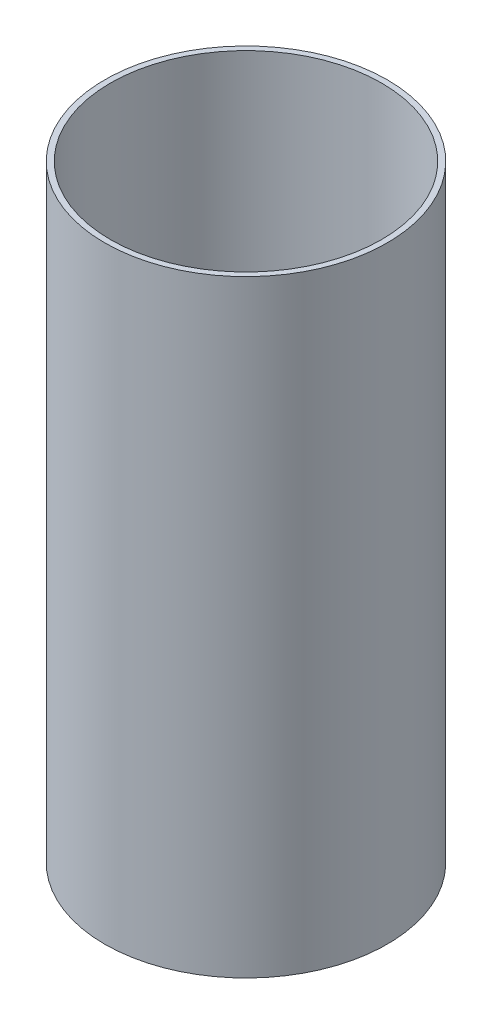
ISO-10303-21;
HEADER;
FILE_DESCRIPTION(('STEP AP214'),'2;1');
FILE_NAME('part.step','',(''),(''),'','','');
FILE_SCHEMA(('AUTOMOTIVE_DESIGN { 1 0 10303 214 1 1 1 1 }'));
ENDSEC;
DATA;
#1=APPLICATION_CONTEXT('core data for automotive mechanical design processes');
#2=APPLICATION_PROTOCOL_DEFINITION('international standard','automotive_design',2000,#1);
#3=PRODUCT_CONTEXT('',#1,'mechanical');
#4=PRODUCT('Part','Part','',(#3));
#5=PRODUCT_RELATED_PRODUCT_CATEGORY('part','',(#4));
#6=PRODUCT_DEFINITION_FORMATION('','',#4);
#7=PRODUCT_DEFINITION_CONTEXT('part definition',#1,'design');
#8=PRODUCT_DEFINITION('design','',#6,#7);
#9=PRODUCT_DEFINITION_SHAPE('','',#8);
#10=(LENGTH_UNIT() NAMED_UNIT(*) SI_UNIT(.MILLI.,.METRE.));
#11=(NAMED_UNIT(*) PLANE_ANGLE_UNIT() SI_UNIT($,.RADIAN.));
#12=(NAMED_UNIT(*) SI_UNIT($,.STERADIAN.) SOLID_ANGLE_UNIT());
#13=UNCERTAINTY_MEASURE_WITH_UNIT(LENGTH_MEASURE(1.E-05),#10,'distance_accuracy_value','');
#14=(GEOMETRIC_REPRESENTATION_CONTEXT(3) GLOBAL_UNCERTAINTY_ASSIGNED_CONTEXT((#13)) GLOBAL_UNIT_ASSIGNED_CONTEXT((#10,
#11,#12)) REPRESENTATION_CONTEXT('',''));
#15=CARTESIAN_POINT('',(0.,0.,0.));
#16=DIRECTION('',(0.,0.,1.));
#17=DIRECTION('',(1.,0.,0.));
#18=AXIS2_PLACEMENT_3D('',#15,#16,#17);
#19=CARTESIAN_POINT('',(0.,81.915,0.));
#20=DIRECTION('',(0.,1.,0.));
#21=DIRECTION('',(0.,0.,1.));
#22=AXIS2_PLACEMENT_3D('',#19,#20,#21);
#23=PLANE('',#22);
#24=CARTESIAN_POINT('',(0.,81.915,0.));
#25=DIRECTION('',(0.,1.,0.));
#26=DIRECTION('',(0.,0.,1.));
#27=AXIS2_PLACEMENT_3D('',#24,#25,#26);
#28=CIRCLE('',#27,38.1);
#29=CARTESIAN_POINT('',(0.,81.915,38.1));
#30=VERTEX_POINT('',#29);
#31=EDGE_CURVE('E10',#30,#30,#28,.T.);
#32=ORIENTED_EDGE('',*,*,#31,.T.);
#33=EDGE_LOOP('',(#32));
#34=FACE_BOUND('',#33,.T.);
#35=CARTESIAN_POINT('',(0.,81.915,0.));
#36=DIRECTION('',(0.,1.,0.));
#37=DIRECTION('',(0.,0.,1.));
#38=AXIS2_PLACEMENT_3D('',#35,#36,#37);
#39=CIRCLE('',#38,36.576);
#40=CARTESIAN_POINT('',(0.,81.915,36.576));
#41=VERTEX_POINT('',#40);
#42=EDGE_CURVE('E64',#41,#41,#39,.T.);
#43=ORIENTED_EDGE('',*,*,#42,.F.);
#44=EDGE_LOOP('',(#43));
#45=FACE_BOUND('',#44,.T.);
#46=ADVANCED_FACE('F41',(#34,#45),#23,.T.);
#47=CARTESIAN_POINT('',(0.,-81.915,0.));
#48=DIRECTION('',(0.,1.,0.));
#49=DIRECTION('',(0.,0.,1.));
#50=AXIS2_PLACEMENT_3D('',#47,#48,#49);
#51=PLANE('',#50);
#52=CARTESIAN_POINT('',(0.,-81.915,0.));
#53=DIRECTION('',(0.,1.,0.));
#54=DIRECTION('',(0.,0.,1.));
#55=AXIS2_PLACEMENT_3D('',#52,#53,#54);
#56=CIRCLE('',#55,38.1);
#57=CARTESIAN_POINT('',(0.,-81.915,38.1));
#58=VERTEX_POINT('',#57);
#59=EDGE_CURVE('E56',#58,#58,#56,.T.);
#60=ORIENTED_EDGE('',*,*,#59,.F.);
#61=EDGE_LOOP('',(#60));
#62=FACE_BOUND('',#61,.T.);
#63=CARTESIAN_POINT('',(0.,-81.915,0.));
#64=DIRECTION('',(0.,1.,0.));
#65=DIRECTION('',(0.,0.,1.));
#66=AXIS2_PLACEMENT_3D('',#63,#64,#65);
#67=CIRCLE('',#66,36.576);
#68=CARTESIAN_POINT('',(0.,-81.915,36.576));
#69=VERTEX_POINT('',#68);
#70=EDGE_CURVE('E66',#69,#69,#67,.T.);
#71=ORIENTED_EDGE('',*,*,#70,.T.);
#72=EDGE_LOOP('',(#71));
#73=FACE_BOUND('',#72,.T.);
#74=ADVANCED_FACE('F88',(#62,#73),#51,.F.);
#75=CARTESIAN_POINT('',(0.,81.915,0.));
#76=DIRECTION('',(0.,-1.,0.));
#77=DIRECTION('',(0.,0.,-1.));
#78=AXIS2_PLACEMENT_3D('',#75,#76,#77);
#79=CYLINDRICAL_SURFACE('',#78,38.1);
#80=CARTESIAN_POINT('',(-37.4542357417689,9.52500000000001,6.98500000000003));
#81=CARTESIAN_POINT('',(-37.4542340335856,9.33053563488091,6.98500341044485));
#82=CARTESIAN_POINT('',(-37.4557531297054,9.13611563494064,6.97687674833695));
#83=CARTESIAN_POINT('',(-37.4617811721207,8.74861793725763,6.94443978947509));
#84=CARTESIAN_POINT('',(-37.4662906694423,8.55554049352782,6.92012651009153));
#85=CARTESIAN_POINT('',(-37.478172796642,8.17206758213388,6.85548221590615));
#86=CARTESIAN_POINT('',(-37.4855470853782,7.98167373472132,6.8151419203492));
#87=CARTESIAN_POINT('',(-37.5029455269161,7.60495734712237,6.71874058764857));
#88=CARTESIAN_POINT('',(-37.5129706537791,7.41863633081762,6.66267377126901));
#89=CARTESIAN_POINT('',(-37.5353642245376,7.05168376238642,6.53533486680278));
#90=CARTESIAN_POINT('',(-37.5477296183793,6.8710451578447,6.46408255479554));
#91=CARTESIAN_POINT('',(-37.5744630618756,6.51638183222883,6.30682841163834));
#92=CARTESIAN_POINT('',(-37.5888318496007,6.34235957889372,6.22082114191047));
#93=CARTESIAN_POINT('',(-37.6191546451127,6.00225955427019,6.03473953227079));
#94=CARTESIAN_POINT('',(-37.6351079050101,5.83617808916155,5.93467181989023));
#95=CARTESIAN_POINT('',(-37.6681651718401,5.51292351574297,5.72110202461112));
#96=CARTESIAN_POINT('',(-37.6852696064969,5.35575375902982,5.60759493622385));
#97=CARTESIAN_POINT('',(-37.7203297592619,5.04986550946477,5.36671988244963));
#98=CARTESIAN_POINT('',(-37.7382924312327,4.90125074469003,5.23922118616097));
#99=CARTESIAN_POINT('',(-37.7744057534238,4.61520389527491,4.97216524633307));
#100=CARTESIAN_POINT('',(-37.7925564708134,4.47777597351091,4.83260355335286));
#101=CARTESIAN_POINT('',(-37.8285269375006,4.21514163007811,4.54245613913194));
#102=CARTESIAN_POINT('',(-37.8463467850673,4.0899315311104,4.39187375890617));
#103=CARTESIAN_POINT('',(-37.8811712736579,3.85250837053135,4.0806116300777));
#104=CARTESIAN_POINT('',(-37.8981756117912,3.74030011639338,3.91992818023199));
#105=CARTESIAN_POINT('',(-37.9310043474684,3.52897690453627,3.58843169489785));
#106=CARTESIAN_POINT('',(-37.9468194993777,3.42996067792578,3.41755477941643));
#107=CARTESIAN_POINT('',(-37.9766865903169,3.24669389935591,3.06790765977003));
#108=CARTESIAN_POINT('',(-37.9907385176212,3.16244344558738,2.88913740312506));
#109=CARTESIAN_POINT('',(-38.0166778327587,3.00934859581149,2.52497930929048));
#110=CARTESIAN_POINT('',(-38.0285653776832,2.94050308162804,2.33959195354005));
#111=CARTESIAN_POINT('',(-38.0498368374673,2.81874134879916,1.96351348205739));
#112=CARTESIAN_POINT('',(-38.0592207246133,2.76582530647969,1.77282230764183));
#113=CARTESIAN_POINT('',(-38.0751238291354,2.67684869532764,1.38970582942301));
#114=CARTESIAN_POINT('',(-38.081674237376,2.64060430831422,1.19732451239956));
#115=CARTESIAN_POINT('',(-38.0918803115573,2.58437082306841,0.810058707322746));
#116=CARTESIAN_POINT('',(-38.0955349778411,2.56438733829797,0.61517337841728));
#117=CARTESIAN_POINT('',(-38.0998391012048,2.54086701930727,0.224450938984987));
#118=CARTESIAN_POINT('',(-38.1004898630556,2.53732304444582,0.0286142786867362));
#119=CARTESIAN_POINT('',(-38.0987778829125,2.54667162184976,-0.362672760191968));
#120=CARTESIAN_POINT('',(-38.0964140331955,2.55957021595904,-0.558122970334558));
#121=CARTESIAN_POINT('',(-38.0849617863367,2.6223465953082,-1.13692982699057));
#122=CARTESIAN_POINT('',(-38.0715664562845,2.69600413494881,-1.51791104494492));
#123=CARTESIAN_POINT('',(-38.0346342605489,2.90502982601209,-2.26179959193677));
#124=CARTESIAN_POINT('',(-38.0110970374096,3.04040015254075,-2.62470628342609));
#125=CARTESIAN_POINT('',(-37.9562951129605,3.36975926436666,-3.32469145626118));
#126=CARTESIAN_POINT('',(-37.9249892013956,3.56406192851881,-3.66161921308306));
#127=CARTESIAN_POINT('',(-37.8581135431649,4.00553905734125,-4.29836436034083));
#128=CARTESIAN_POINT('',(-37.8225433814101,4.25271867098203,-4.59817813225638));
#129=CARTESIAN_POINT('',(-37.7504673261026,4.79723843272334,-5.15682435406442));
#130=CARTESIAN_POINT('',(-37.7139553598422,5.09526102638323,-5.41499133388232));
#131=CARTESIAN_POINT('',(-37.6446105303586,5.73072821686358,-5.87777391971751));
#132=CARTESIAN_POINT('',(-37.6117777164019,6.06817334145609,-6.08238880868336));
#133=CARTESIAN_POINT('',(-37.5535009560369,6.7737659593542,-6.43243770481421));
#134=CARTESIAN_POINT('',(-37.528068668238,7.14196073322787,-6.5777784760357));
#135=CARTESIAN_POINT('',(-37.4876537243386,7.89811331766966,-6.80435117102319));
#136=CARTESIAN_POINT('',(-37.4726699401927,8.2860689899497,-6.88559001551091));
#137=CARTESIAN_POINT('',(-37.4550707216549,9.06473907859715,-6.98068846629741));
#138=CARTESIAN_POINT('',(-37.4522800715632,9.45533306740576,-6.99550267847479));
#139=CARTESIAN_POINT('',(-37.4589146767246,10.233414626111,-6.95988701100482));
#140=CARTESIAN_POINT('',(-37.4683393558095,10.6209023416559,-6.90946020862246));
#141=CARTESIAN_POINT('',(-37.4981797480304,11.3786558197193,-6.74561267808341));
#142=CARTESIAN_POINT('',(-37.5185086394037,11.7490328579779,-6.63268933847964));
#143=CARTESIAN_POINT('',(-37.567792546678,12.4656090114587,-6.34757931682258));
#144=CARTESIAN_POINT('',(-37.5967481738298,12.8118064112764,-6.17538843520962));
#145=CARTESIAN_POINT('',(-37.6604235753204,13.4744091941903,-5.7744275538859));
#146=CARTESIAN_POINT('',(-37.695203570055,13.7904426499109,-5.54505274003573));
#147=CARTESIAN_POINT('',(-37.7664385352839,14.3798824100197,-5.03703452095226));
#148=CARTESIAN_POINT('',(-37.8028936492712,14.6532850537518,-4.75838688910142));
#149=CARTESIAN_POINT('',(-37.8739308661826,15.1532330669894,-4.15554851880031));
#150=CARTESIAN_POINT('',(-37.908483202911,15.3791373474489,-3.83082296491047));
#151=CARTESIAN_POINT('',(-37.9713324109234,15.7732309136104,-3.14725574581758));
#152=CARTESIAN_POINT('',(-37.9996295154769,15.9414223516625,-2.78841535353516));
#153=CARTESIAN_POINT('',(-38.0349216614478,16.1461665040589,-2.23364848592048));
#154=CARTESIAN_POINT('',(-38.0454793436149,16.2064168828023,-2.04636875526318));
#155=CARTESIAN_POINT('',(-38.0639729117851,16.3109370736754,-1.66729216906996));
#156=CARTESIAN_POINT('',(-38.0719097493761,16.3552126865356,-1.47549698018324));
#157=CARTESIAN_POINT('',(-38.0849325342111,16.4274318728175,-1.08875211294535));
#158=CARTESIAN_POINT('',(-38.0900181727629,16.455373677832,-0.893802095378592));
#159=CARTESIAN_POINT('',(-38.0971934628091,16.4947024659574,-0.502186155801176));
#160=CARTESIAN_POINT('',(-38.0992832165704,16.5060900141614,-0.305520292592865));
#161=CARTESIAN_POINT('',(-38.1003983111704,16.5121727623074,0.0851950602812925));
#162=CARTESIAN_POINT('',(-38.0994680560968,16.5071098375054,0.27924071386786));
#163=CARTESIAN_POINT('',(-38.0946665212248,16.4808614634748,0.666198873364108));
#164=CARTESIAN_POINT('',(-38.090795294647,16.4596763059992,0.85911139971555));
#165=CARTESIAN_POINT('',(-38.0802188116775,16.4013442927533,1.24246182581911));
#166=CARTESIAN_POINT('',(-38.0735130690796,16.3641946985762,1.43289929524416));
#167=CARTESIAN_POINT('',(-38.0574567584225,16.2742366633475,1.80985156272999));
#168=CARTESIAN_POINT('',(-38.0481071396432,16.2214338422359,1.99636774294751));
#169=CARTESIAN_POINT('',(-38.0270339709624,16.1006419190123,2.36401125976492));
#170=CARTESIAN_POINT('',(-38.0153134686137,16.0326723009749,2.54514517539169));
#171=CARTESIAN_POINT('',(-37.9898170066066,15.8820375114483,2.90096733230066));
#172=CARTESIAN_POINT('',(-37.9760417799685,15.7993775787055,3.07565784465058));
#173=CARTESIAN_POINT('',(-37.9468021908692,15.6199043960138,3.4175511798841));
#174=CARTESIAN_POINT('',(-37.9313371522119,15.5230854749134,3.58475096726047));
#175=CARTESIAN_POINT('',(-37.8991479363645,15.3160353053634,3.91041622446113));
#176=CARTESIAN_POINT('',(-37.8824241981317,15.2058087244975,4.06888470614303));
#177=CARTESIAN_POINT('',(-37.84792345255,14.9710263064341,4.37827159414282));
#178=CARTESIAN_POINT('',(-37.8301349213764,14.8462903876144,4.52905208934451));
#179=CARTESIAN_POINT('',(-37.7942242408193,14.5846825290564,4.8195468060831));
#180=CARTESIAN_POINT('',(-37.7761022118906,14.4478149055073,4.95926493013616));
#181=CARTESIAN_POINT('',(-37.74001221561,14.1627519304102,5.22682665540355));
#182=CARTESIAN_POINT('',(-37.7220443469253,14.0145498501586,5.35466310173463));
#183=CARTESIAN_POINT('',(-37.6867838719834,13.7079511358921,5.59744293554292));
#184=CARTESIAN_POINT('',(-37.6694910195735,13.5495582749374,5.71239105208564));
#185=CARTESIAN_POINT('',(-37.6359081775295,13.2221028358249,5.92963853380615));
#186=CARTESIAN_POINT('',(-37.6196288528839,13.0529556495923,6.03181208086625));
#187=CARTESIAN_POINT('',(-37.5887265833075,12.7065620244151,6.22148431584868));
#188=CARTESIAN_POINT('',(-37.5741030291187,12.529318598479,6.30898840728383));
#189=CARTESIAN_POINT('',(-37.5469436812541,12.1680311250058,6.46866165555627));
#190=CARTESIAN_POINT('',(-37.5344065205077,11.9839916278465,6.54084086236058));
#191=CARTESIAN_POINT('',(-37.5117821927866,11.6103829579479,6.6693657831704));
#192=CARTESIAN_POINT('',(-37.5016945241731,11.4208149263357,6.72571473947118));
#193=CARTESIAN_POINT('',(-37.4803486169003,10.9510850423096,6.84387466667992));
#194=CARTESIAN_POINT('',(-37.4706070159754,10.6685499868737,6.89672921060662));
#195=CARTESIAN_POINT('',(-37.4575519194361,10.0989776810425,6.96728891944052));
#196=CARTESIAN_POINT('',(-37.4542382622669,9.81194054398164,6.98499496774185));
#197=CARTESIAN_POINT('',(-37.4542357417689,9.52500000000001,6.98500000000003));
#198=B_SPLINE_CURVE_WITH_KNOTS('',3,(#80,#81,#82,#83,#84,#85,#86,#87,#88,#89,#90,#91,#92,#93,
#94,#95,#96,#97,#98,#99,#100,#101,#102,#103,#104,#105,#106,#107,#108,#109,#110,#111,#112,#113,
#114,#115,#116,#117,#118,#119,#120,#121,#122,#123,#124,#125,#126,#127,#128,#129,#130,#131,#132,
#133,#134,#135,#136,#137,#138,#139,#140,#141,#142,#143,#144,#145,#146,#147,#148,#149,#150,#151,
#152,#153,#154,#155,#156,#157,#158,#159,#160,#161,#162,#163,#164,#165,#166,#167,#168,#169,#170,
#171,#172,#173,#174,#175,#176,#177,#178,#179,#180,#181,#182,#183,#184,#185,#186,#187,#188,#189,
#190,#191,#192,#193,#194,#195,#196,#197),.UNSPECIFIED.,.T.,.F.,(4,2,2,2,2,2,2,2,2,2,2,2,2,2,2,2,
2,2,2,2,2,2,2,2,2,2,2,2,2,2,2,2,2,2,2,2,2,2,2,2,2,2,2,2,2,2,2,2,2,2,2,2,2,2,2,2,2,2,4),(0.,
0.583141180163312,1.16638984268001,1.749976740089,2.33377837761673,2.91682432567044,
3.50008564408909,4.08307295298482,4.66627808230469,5.25549051982042,5.84492122365618,
6.43417397089886,7.02364390561284,7.61730358335937,8.21096720873078,8.80458772871017,
9.39821481933212,9.98512982282332,10.5722473506848,11.159109835151,11.7461880251918,
12.9050114787165,14.063875778861,15.229024033336,16.3942857975186,17.5766361341407,
18.7590023013801,19.9432211785348,21.1273121847887,22.2943306055199,23.4612939827479,
24.6191007441662,25.7769895619634,26.9476870898477,28.1184850888107,29.3041936605192,
30.4898580074557,31.0803169492356,31.670561268249,32.2608694792307,32.8511575390869,
33.4328059479825,34.014443831438,34.5961815240743,35.1777106092765,35.7584968887696,
36.3390764668387,36.9198892267196,37.5005003649297,38.089295701491,38.6778823922634,
39.2668212511858,39.8555433009121,40.4496704423675,41.0435782531635,41.6370953714946,
42.2304908389992,43.0909623859048,43.9514123061341),.UNSPECIFIED.);
#199=CARTESIAN_POINT('',(-37.4542357417689,9.52500000000001,6.98500000000003));
#200=VERTEX_POINT('',#199);
#201=EDGE_CURVE('E69',#200,#200,#198,.T.);
#202=ORIENTED_EDGE('',*,*,#201,.T.);
#203=EDGE_LOOP('',(#202));
#204=FACE_BOUND('',#203,.T.);
#205=ORIENTED_EDGE('',*,*,#31,.F.);
#206=EDGE_LOOP('',(#205));
#207=FACE_BOUND('',#206,.T.);
#208=ORIENTED_EDGE('',*,*,#59,.T.);
#209=EDGE_LOOP('',(#208));
#210=FACE_BOUND('',#209,.T.);
#211=ADVANCED_FACE('F43',(#204,#207,#210),#79,.T.);
#212=CARTESIAN_POINT('',(0.,81.915,0.));
#213=DIRECTION('',(0.,-1.,0.));
#214=DIRECTION('',(0.,0.,-1.));
#215=AXIS2_PLACEMENT_3D('',#212,#213,#214);
#216=CYLINDRICAL_SURFACE('',#215,36.576);
#217=CARTESIAN_POINT('',(-35.9028348602168,9.52500000000001,6.98500000000003));
#218=CARTESIAN_POINT('',(-35.9028329753735,9.33068797986838,6.98500361783521));
#219=CARTESIAN_POINT('',(-35.9044153048285,9.13642215990568,6.97688956790707));
#220=CARTESIAN_POINT('',(-35.9106938342466,8.74923397362164,6.94450416095963));
#221=CARTESIAN_POINT('',(-35.9153905868995,8.55631185189652,6.92022993612988));
#222=CARTESIAN_POINT('',(-35.9277654859925,8.17315576439946,6.85569215558859));
#223=CARTESIAN_POINT('',(-35.9354452821046,7.98292334651273,6.81541975234081));
#224=CARTESIAN_POINT('',(-35.953563567229,7.60652910454176,6.71918444079919));
#225=CARTESIAN_POINT('',(-35.9640030708921,7.4203688049505,6.66321576105482));
#226=CARTESIAN_POINT('',(-35.9873205814073,7.05374096897076,6.53610727846295));
#227=CARTESIAN_POINT('',(-36.0001953193236,6.8732661752073,6.46498779731124));
#228=CARTESIAN_POINT('',(-36.0280285945052,6.51892186396661,6.30803313828899));
#229=CARTESIAN_POINT('',(-36.0429878998931,6.34505481150746,6.22219253326984));
#230=CARTESIAN_POINT('',(-36.0745560141865,6.00524846555872,6.0364763923574));
#231=CARTESIAN_POINT('',(-36.0911640646923,5.83930557861177,5.93660730067887));
#232=CARTESIAN_POINT('',(-36.1255777688703,5.51630704743734,5.72346572419428));
#233=CARTESIAN_POINT('',(-36.1433838681125,5.35925475017077,5.61018824060578));
#234=CARTESIAN_POINT('',(-36.1798993704337,5.05343679354111,5.36969369492585));
#235=CARTESIAN_POINT('',(-36.1986166594374,4.90478370412141,5.2423346621407));
#236=CARTESIAN_POINT('',(-36.2362488837847,4.61864596498278,4.97555933496527));
#237=CARTESIAN_POINT('',(-36.2551638897912,4.48116547383584,4.83613859056701));
#238=CARTESIAN_POINT('',(-36.2926515575692,4.21840834612585,4.546269303744));
#239=CARTESIAN_POINT('',(-36.3112243200554,4.0931280712606,4.39582407259906));
#240=CARTESIAN_POINT('',(-36.3475235891009,3.85554571380521,4.08482780534049));
#241=CARTESIAN_POINT('',(-36.3652497812531,3.74324843129517,3.92427306520505));
#242=CARTESIAN_POINT('',(-36.3994875467953,3.53165941852081,3.59291438380365));
#243=CARTESIAN_POINT('',(-36.4159886361723,3.43247528592513,3.42204062308894));
#244=CARTESIAN_POINT('',(-36.4471550437375,3.24887471024754,3.07237213580042));
#245=CARTESIAN_POINT('',(-36.4618203510975,3.16445835427132,2.89357736251339));
#246=CARTESIAN_POINT('',(-36.4888961929486,3.0110381502788,2.52934249180687));
#247=CARTESIAN_POINT('',(-36.5013069012159,2.94203311432092,2.34390290786494));
#248=CARTESIAN_POINT('',(-36.5235193341164,2.81996317178785,1.96769277118591));
#249=CARTESIAN_POINT('',(-36.5333210326849,2.76689842445959,1.77692216521157));
#250=CARTESIAN_POINT('',(-36.5499302700474,2.67768290461067,1.393801519545));
#251=CARTESIAN_POINT('',(-36.5567729566997,2.64133323757315,1.20149931990298));
#252=CARTESIAN_POINT('',(-36.5674456669889,2.58487765366159,0.814376342195757));
#253=CARTESIAN_POINT('',(-36.5712746505403,2.56477734468095,0.619554718187034));
#254=CARTESIAN_POINT('',(-36.575804222258,2.54101440929261,0.228947737543413));
#255=CARTESIAN_POINT('',(-36.5765061880158,2.53734454453505,0.0331628433363012));
#256=CARTESIAN_POINT('',(-36.5747724392089,2.54643331927223,-0.358030959128405));
#257=CARTESIAN_POINT('',(-36.5723355717361,2.55919799524947,-0.553439702816283));
#258=CARTESIAN_POINT('',(-36.5604911431127,2.62152166283696,-1.13173906316758));
#259=CARTESIAN_POINT('',(-36.54661071004,2.69478310325954,-1.51227133232971));
#260=CARTESIAN_POINT('',(-36.5083022642072,2.90285258252099,-2.25532662612192));
#261=CARTESIAN_POINT('',(-36.4838738565529,3.0376629256327,-2.61784897593168));
#262=CARTESIAN_POINT('',(-36.4269554353573,3.36580300627209,-3.31730730595083));
#263=CARTESIAN_POINT('',(-36.3944193161706,3.55946886685401,-3.65408203823151));
#264=CARTESIAN_POINT('',(-36.3248785866319,3.99957454074632,-4.29065311193078));
#265=CARTESIAN_POINT('',(-36.2878735057281,4.24601991350038,-4.59044555263334));
#266=CARTESIAN_POINT('',(-36.2127966006635,4.78934206803712,-5.14957304479605));
#267=CARTESIAN_POINT('',(-36.1747171709437,5.08695856171539,-5.40818884973671));
#268=CARTESIAN_POINT('',(-36.1023445921121,5.72171551312732,-5.87194621130979));
#269=CARTESIAN_POINT('',(-36.0680515025871,6.05885659270021,-6.07708692645636));
#270=CARTESIAN_POINT('',(-36.0071222778929,6.76406775104265,-6.42828908505325));
#271=CARTESIAN_POINT('',(-35.9805001348793,7.13219278590265,-6.57424276365659));
#272=CARTESIAN_POINT('',(-35.9381387340724,7.88836397651526,-6.80202305325338));
#273=CARTESIAN_POINT('',(-35.922398193294,8.27640777796706,-6.88385722434833));
#274=CARTESIAN_POINT('',(-35.9038369037421,9.05490599265663,-6.980018693169));
#275=CARTESIAN_POINT('',(-35.9008181145096,9.44522798924327,-6.99538086744337));
#276=CARTESIAN_POINT('',(-35.9075117346432,10.2228591607972,-6.96093914452254));
#277=CARTESIAN_POINT('',(-35.9172234894965,10.6101684896244,-6.91113859752504));
#278=CARTESIAN_POINT('',(-35.9480991725755,11.3673570294089,-6.74867490939536));
#279=CARTESIAN_POINT('',(-35.9691637031222,11.7373576706172,-6.63655711564499));
#280=CARTESIAN_POINT('',(-36.0202854804458,12.4533222054807,-6.3532200346908));
#281=CARTESIAN_POINT('',(-36.0503434114493,12.7992842677892,-6.18199625049464));
#282=CARTESIAN_POINT('',(-36.116514427862,13.461900477981,-5.78294152693164));
#283=CARTESIAN_POINT('',(-36.1526955809919,13.7781549851876,-5.55445857366924));
#284=CARTESIAN_POINT('',(-36.2268466175501,14.3682137871262,-5.04822859309373));
#285=CARTESIAN_POINT('',(-36.2648166678572,14.642014111218,-4.77047696299913));
#286=CARTESIAN_POINT('',(-36.3389036056207,15.1432552873601,-4.16903769129143));
#287=CARTESIAN_POINT('',(-36.3749874018974,15.3699989155853,-3.84476525576382));
#288=CARTESIAN_POINT('',(-36.4406813175082,15.7658360572692,-3.16190963534309));
#289=CARTESIAN_POINT('',(-36.4702916924808,15.934931847415,-2.80332780614796));
#290=CARTESIAN_POINT('',(-36.5072715991116,16.1410207375425,-2.24884660053324));
#291=CARTESIAN_POINT('',(-36.5183429335416,16.201710698005,-2.06167544910241));
#292=CARTESIAN_POINT('',(-36.5377605360747,16.3071172649129,-1.68276708815377));
#293=CARTESIAN_POINT('',(-36.5461077971738,16.3518396925013,-1.4910315698743));
#294=CARTESIAN_POINT('',(-36.5598362011735,16.4249532277444,-1.10435975505616));
#295=CARTESIAN_POINT('',(-36.5652170430221,16.4533426778313,-0.909423135714818));
#296=CARTESIAN_POINT('',(-36.5728589958747,16.4935621096078,-0.517789998141056));
#297=CARTESIAN_POINT('',(-36.5751202164864,16.5053926730932,-0.321093541984836));
#298=CARTESIAN_POINT('',(-36.5764471133679,16.5123415342541,0.0694772209730845));
#299=CARTESIAN_POINT('',(-36.5755629528996,16.5077221778416,0.263346754587047));
#300=CARTESIAN_POINT('',(-36.5707351062529,16.4823895777486,0.649990117388783));
#301=CARTESIAN_POINT('',(-36.5667914765251,16.4616766310122,0.842763966727015));
#302=CARTESIAN_POINT('',(-36.5559535542796,16.4043154373633,1.22587403157712));
#303=CARTESIAN_POINT('',(-36.5490587625191,16.3676644942315,1.41620982903459));
#304=CARTESIAN_POINT('',(-36.5325127523709,16.2787280820231,1.79299706939617));
#305=CARTESIAN_POINT('',(-36.5228625215145,16.2264482139358,1.97944987829722));
#306=CARTESIAN_POINT('',(-36.5010878679859,16.1067414070217,2.34695435416393));
#307=CARTESIAN_POINT('',(-36.4889673292862,16.0393382294286,2.52801399459958));
#308=CARTESIAN_POINT('',(-36.4625788222548,15.8898652359633,2.88373416115148));
#309=CARTESIAN_POINT('',(-36.4483116177019,15.8078006346527,3.0583969358841));
#310=CARTESIAN_POINT('',(-36.418007818565,15.629543880625,3.40028682061126));
#311=CARTESIAN_POINT('',(-36.4019705071685,15.5333459993151,3.56751087952175));
#312=CARTESIAN_POINT('',(-36.3685707701417,15.3275588684664,3.8932817196547));
#313=CARTESIAN_POINT('',(-36.3512088039828,15.2179742544103,4.05183147718573));
#314=CARTESIAN_POINT('',(-36.3153520806231,14.9843739147035,4.36161245715059));
#315=CARTESIAN_POINT('',(-36.2968441264433,14.860164340496,4.51269600974449));
#316=CARTESIAN_POINT('',(-36.2594596117605,14.5995910915168,4.80384260982017));
#317=CARTESIAN_POINT('',(-36.24058318368,14.4632317225614,4.94390952866145));
#318=CARTESIAN_POINT('',(-36.2029686606721,14.1791610875057,5.21221671072606));
#319=CARTESIAN_POINT('',(-36.1842306552346,14.0314430806042,5.34044985031021));
#320=CARTESIAN_POINT('',(-36.1474355765072,13.725780119949,5.5840713813286));
#321=CARTESIAN_POINT('',(-36.1293782553298,13.56783894727,5.69946447924638));
#322=CARTESIAN_POINT('',(-36.0942706028178,13.241107686803,5.91774908313638));
#323=CARTESIAN_POINT('',(-36.0772322277992,13.072224451361,6.02050316077414));
#324=CARTESIAN_POINT('',(-36.044863821602,12.7262964651275,6.2113554650932));
#325=CARTESIAN_POINT('',(-36.0295331619158,12.549254751123,6.29945908965048));
#326=CARTESIAN_POINT('',(-36.0010332108241,12.1883007883259,6.4603454548015));
#327=CARTESIAN_POINT('',(-35.9878625483068,12.0043929896947,6.53313792289071));
#328=CARTESIAN_POINT('',(-35.9640648238074,11.6309803371143,6.66289373238967));
#329=CARTESIAN_POINT('',(-35.9534372538451,11.4414766094569,6.71986023538776));
#330=CARTESIAN_POINT('',(-35.9307489832198,10.9685693706281,6.84035662002582));
#331=CARTESIAN_POINT('',(-35.920337020135,10.6826458194628,6.89452643955429));
#332=CARTESIAN_POINT('',(-35.9063814674633,10.1061136662916,6.96684490137544));
#333=CARTESIAN_POINT('',(-35.9028376781422,9.81550520077612,6.98499459117388));
#334=CARTESIAN_POINT('',(-35.9028348602168,9.52500000000001,6.98500000000003));
#335=B_SPLINE_CURVE_WITH_KNOTS('',3,(#217,#218,#219,#220,#221,#222,#223,#224,#225,#226,#227,
#228,#229,#230,#231,#232,#233,#234,#235,#236,#237,#238,#239,#240,#241,#242,#243,#244,#245,#246,
#247,#248,#249,#250,#251,#252,#253,#254,#255,#256,#257,#258,#259,#260,#261,#262,#263,#264,#265,
#266,#267,#268,#269,#270,#271,#272,#273,#274,#275,#276,#277,#278,#279,#280,#281,#282,#283,#284,
#285,#286,#287,#288,#289,#290,#291,#292,#293,#294,#295,#296,#297,#298,#299,#300,#301,#302,#303,
#304,#305,#306,#307,#308,#309,#310,#311,#312,#313,#314,#315,#316,#317,#318,#319,#320,#321,#322,
#323,#324,#325,#326,#327,#328,#329,#330,#331,#332,#333,#334),.UNSPECIFIED.,.T.,.F.,(4,2,2,2,2,2,
2,2,2,2,2,2,2,2,2,2,2,2,2,2,2,2,2,2,2,2,2,2,2,2,2,2,2,2,2,2,2,2,2,2,2,2,2,2,2,2,2,2,2,2,2,2,2,2,
2,2,2,2,4),(0.,0.582680874360056,1.1654651797719,1.74857223440272,2.33189397662862,
2.91443818377103,3.49719761750386,4.07969022132061,4.66240067224482,5.25164039040128,
5.8410984354271,6.43038015271823,7.01987904755963,7.61394894868091,8.20802235372337,
8.8020499503433,9.39608348122971,9.98285298426356,10.5698249037707,11.1565382102792,
11.7434670807798,12.9008043854726,14.0581850222071,15.2223037792036,16.3865452171095,
17.5693023674212,18.7520781285168,19.9369978634044,21.1217778676171,22.2880445770387,
23.4542513277836,24.6104095597447,25.7666557756992,26.9367193447674,28.1068922812145,
29.2933290214425,30.4797189002722,31.0703561741045,31.6607779041078,32.2512595430547,
32.8417204349263,33.4228070307911,34.0038829052323,34.5850571181223,35.1660233028646,
35.7460830067524,36.3259368126789,36.906026300456,37.4859154844809,38.0746092731089,
38.663095255658,39.2519332122237,39.840554615796,40.4350969202029,41.0294196811753,
41.6233637084074,42.2171889966537,43.088348419058,43.9594825067985),.UNSPECIFIED.);
#336=CARTESIAN_POINT('',(-35.9028348602168,9.52500000000001,6.98500000000003));
#337=VERTEX_POINT('',#336);
#338=EDGE_CURVE('E46',#337,#337,#335,.T.);
#339=ORIENTED_EDGE('',*,*,#338,.F.);
#340=EDGE_LOOP('',(#339));
#341=FACE_BOUND('',#340,.T.);
#342=ORIENTED_EDGE('',*,*,#42,.T.);
#343=EDGE_LOOP('',(#342));
#344=FACE_BOUND('',#343,.T.);
#345=ORIENTED_EDGE('',*,*,#70,.F.);
#346=EDGE_LOOP('',(#345));
#347=FACE_BOUND('',#346,.T.);
#348=ADVANCED_FACE('F80',(#341,#344,#347),#216,.F.);
#349=CARTESIAN_POINT('',(-31.75,9.52500000000001,0.));
#350=DIRECTION('',(-1.,0.,0.));
#351=DIRECTION('',(0.,0.,1.));
#352=AXIS2_PLACEMENT_3D('',#349,#350,#351);
#353=CYLINDRICAL_SURFACE('',#352,6.98500000000003);
#354=ORIENTED_EDGE('',*,*,#338,.T.);
#355=EDGE_LOOP('',(#354));
#356=FACE_BOUND('',#355,.T.);
#357=ORIENTED_EDGE('',*,*,#201,.F.);
#358=EDGE_LOOP('',(#357));
#359=FACE_BOUND('',#358,.T.);
#360=ADVANCED_FACE('F77',(#356,#359),#353,.F.);
#361=CLOSED_SHELL('',(#46,#74,#211,#348,#360));
#362=MANIFOLD_SOLID_BREP('B2',#361);
#363=ADVANCED_BREP_SHAPE_REPRESENTATION('',(#18,#362),#14);
#364=SHAPE_DEFINITION_REPRESENTATION(#9,#363);
ENDSEC;
END-ISO-10303-21;
